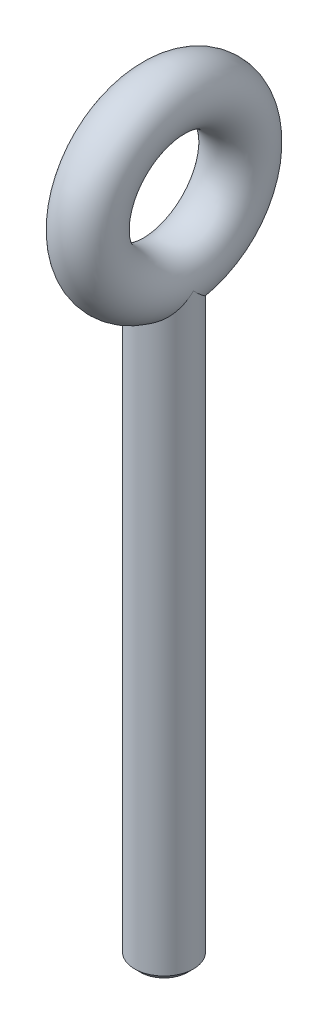
ISO-10303-21;
HEADER;
FILE_DESCRIPTION(('STEP AP214'),'2;1');
FILE_NAME('part.step','',(''),(''),'','','');
FILE_SCHEMA(('AUTOMOTIVE_DESIGN { 1 0 10303 214 1 1 1 1 }'));
ENDSEC;
DATA;
#1=APPLICATION_CONTEXT('core data for automotive mechanical design processes');
#2=APPLICATION_PROTOCOL_DEFINITION('international standard','automotive_design',2000,#1);
#3=PRODUCT_CONTEXT('',#1,'mechanical');
#4=PRODUCT('Part','Part','',(#3));
#5=PRODUCT_RELATED_PRODUCT_CATEGORY('part','',(#4));
#6=PRODUCT_DEFINITION_FORMATION('','',#4);
#7=PRODUCT_DEFINITION_CONTEXT('part definition',#1,'design');
#8=PRODUCT_DEFINITION('design','',#6,#7);
#9=PRODUCT_DEFINITION_SHAPE('','',#8);
#10=(LENGTH_UNIT() NAMED_UNIT(*) SI_UNIT(.MILLI.,.METRE.));
#11=(NAMED_UNIT(*) PLANE_ANGLE_UNIT() SI_UNIT($,.RADIAN.));
#12=(NAMED_UNIT(*) SI_UNIT($,.STERADIAN.) SOLID_ANGLE_UNIT());
#13=UNCERTAINTY_MEASURE_WITH_UNIT(LENGTH_MEASURE(1.E-05),#10,'distance_accuracy_value','');
#14=(GEOMETRIC_REPRESENTATION_CONTEXT(3) GLOBAL_UNCERTAINTY_ASSIGNED_CONTEXT((#13)) GLOBAL_UNIT_ASSIGNED_CONTEXT((#10,
#11,#12)) REPRESENTATION_CONTEXT('',''));
#15=CARTESIAN_POINT('',(0.,0.,0.));
#16=DIRECTION('',(0.,0.,1.));
#17=DIRECTION('',(1.,0.,0.));
#18=AXIS2_PLACEMENT_3D('',#15,#16,#17);
#19=CARTESIAN_POINT('',(0.,57.,0.));
#20=DIRECTION('',(1.,0.,0.));
#21=DIRECTION('',(0.,0.,-1.));
#22=AXIS2_PLACEMENT_3D('',#19,#20,#21);
#23=TOROIDAL_SURFACE('',#22,6.5,2.5);
#24=CARTESIAN_POINT('',(2.5,50.5,0.));
#25=CARTESIAN_POINT('',(2.4999998519753,50.4651649450499,-0.0348344505926963));
#26=CARTESIAN_POINT('',(2.49927189941043,50.4304676053622,-0.0698082826245151));
#27=CARTESIAN_POINT('',(2.49633216551129,50.3615765351389,-0.139792227453699));
#28=CARTESIAN_POINT('',(2.49412892246899,50.3273810572834,-0.174800980537361));
#29=CARTESIAN_POINT('',(2.48822941530882,50.2595312191127,-0.244796587317837));
#30=CARTESIAN_POINT('',(2.48454243864865,50.2258748225426,-0.279782245642682));
#31=CARTESIAN_POINT('',(2.47566870387325,50.1591399280342,-0.349669598496871));
#32=CARTESIAN_POINT('',(2.47049199876416,50.1260590825694,-0.384570324713654));
#33=CARTESIAN_POINT('',(2.45863483508742,50.0605110677205,-0.454223498115312));
#34=CARTESIAN_POINT('',(2.45196520328561,50.0280412191219,-0.488975262976044));
#35=CARTESIAN_POINT('',(2.43712097010707,49.9637498764985,-0.558263726688536));
#36=CARTESIAN_POINT('',(2.42895797074275,49.9319253523633,-0.59280009522945));
#37=CARTESIAN_POINT('',(2.41112871125689,49.8689584869557,-0.661589292403945));
#38=CARTESIAN_POINT('',(2.40147482070587,49.837812744329,-0.695842208097105));
#39=CARTESIAN_POINT('',(2.38066814398586,49.7762352340584,-0.763993019045368));
#40=CARTESIAN_POINT('',(2.3695284804141,49.7457996840722,-0.797891499132737));
#41=CARTESIAN_POINT('',(2.34503626255162,49.6838497018394,-0.867312180624518));
#42=CARTESIAN_POINT('',(2.33159898290379,49.6523610258926,-0.902827554412127));
#43=CARTESIAN_POINT('',(2.30302708267719,49.590198054588,-0.973385329518642));
#44=CARTESIAN_POINT('',(2.28790563583952,49.5595194797625,-1.00842928926444));
#45=CARTESIAN_POINT('',(2.25597165670608,49.4990190219382,-1.07795984691651));
#46=CARTESIAN_POINT('',(2.23917299705823,49.4691923704029,-1.11244865831707));
#47=CARTESIAN_POINT('',(2.20389555666032,49.4104387224069,-1.18078394377793));
#48=CARTESIAN_POINT('',(2.18543126933451,49.3815064425272,-1.21463334819587));
#49=CARTESIAN_POINT('',(2.14683788839919,49.3245835551725,-1.28160347350607));
#50=CARTESIAN_POINT('',(2.12672381551575,49.2965871411921,-1.31472790469029));
#51=CARTESIAN_POINT('',(2.08485076598944,49.2415774283213,-1.38016096068789));
#52=CARTESIAN_POINT('',(2.06310722314869,49.21455779598,-1.41247412647261));
#53=CARTESIAN_POINT('',(2.01799983536828,49.1615425293011,-1.47619745561843));
#54=CARTESIAN_POINT('',(1.99465170286396,49.1355400396073,-1.50761302420075));
#55=CARTESIAN_POINT('',(1.94636440869489,49.0845989296952,-1.56945289650164));
#56=CARTESIAN_POINT('',(1.92144108489697,49.059652952365,-1.5998834968128));
#57=CARTESIAN_POINT('',(1.86827481321106,49.0091920995661,-1.66172044012805));
#58=CARTESIAN_POINT('',(1.83992261267587,48.9837314862613,-1.69307733209746));
#59=CARTESIAN_POINT('',(1.78149743865257,48.9341316306051,-1.75444632253051));
#60=CARTESIAN_POINT('',(1.75144413676242,48.9099818533725,-1.78446861568752));
#61=CARTESIAN_POINT('',(1.68967262573154,48.8630476111479,-1.84306459913477));
#62=CARTESIAN_POINT('',(1.65797349366026,48.8402521351544,-1.87164955443035));
#63=CARTESIAN_POINT('',(1.59297332072478,48.7960704029711,-1.92727019017921));
#64=CARTESIAN_POINT('',(1.55969045668714,48.7746727732271,-1.95431805353104));
#65=CARTESIAN_POINT('',(1.49159173930169,48.7333293460177,-2.00676708176753));
#66=CARTESIAN_POINT('',(1.45679286813338,48.7133719724325,-2.03218113991));
#67=CARTESIAN_POINT('',(1.38573871319276,48.6749512938846,-2.08126845902745));
#68=CARTESIAN_POINT('',(1.34949891991776,48.6564763980875,-2.10495505796956));
#69=CARTESIAN_POINT('',(1.2756413013032,48.6210602148965,-2.15050004763789));
#70=CARTESIAN_POINT('',(1.23803725698496,48.6041075664873,-2.17237186936554));
#71=CARTESIAN_POINT('',(1.18056518589665,48.5798168441105,-2.20379997485232));
#72=CARTESIAN_POINT('',(1.16128646235409,48.5719304635984,-2.21401896202216));
#73=CARTESIAN_POINT('',(1.12242007277858,48.5565545799554,-2.23397052295273));
#74=CARTESIAN_POINT('',(1.10283375518018,48.5490637606325,-2.24370470278832));
#75=CARTESIAN_POINT('',(1.06225218019391,48.5340735063834,-2.26321219369763));
#76=CARTESIAN_POINT('',(1.04123722038652,48.5265946016373,-2.27296030480897));
#77=CARTESIAN_POINT('',(0.998921100046556,48.5121017732341,-2.29187752025771));
#78=CARTESIAN_POINT('',(0.977621761813773,48.505085818838,-2.30104914360219));
#79=CARTESIAN_POINT('',(0.934752733102131,48.4915218190078,-2.318803311869));
#80=CARTESIAN_POINT('',(0.913184671359649,48.4849718268857,-2.32738830085755));
#81=CARTESIAN_POINT('',(0.869794416154352,48.4723426722087,-2.34395998326549));
#82=CARTESIAN_POINT('',(0.847973657026655,48.4662616606127,-2.35194902176108));
#83=CARTESIAN_POINT('',(0.804094486610989,48.4545732562204,-2.36732011428389));
#84=CARTESIAN_POINT('',(0.782037317347516,48.4489641263156,-2.37470439165565));
#85=CARTESIAN_POINT('',(0.737702078084783,48.4382221809127,-2.38885790757353));
#86=CARTESIAN_POINT('',(0.715425062374308,48.4330877543173,-2.39562922467928));
#87=CARTESIAN_POINT('',(0.670667132288324,48.4232978117753,-2.40854939010881));
#88=CARTESIAN_POINT('',(0.648187091742627,48.4186408246102,-2.41470014967389));
#89=CARTESIAN_POINT('',(0.603040352050533,48.4098082632042,-2.42637241392847));
#90=CARTESIAN_POINT('',(0.58037435624373,48.4056313710396,-2.43189564077238));
#91=CARTESIAN_POINT('',(0.534873168729661,48.3977614099155,-2.4423067074885));
#92=CARTESIAN_POINT('',(0.512038522509422,48.3940671890994,-2.44719605982718));
#93=CARTESIAN_POINT('',(0.466217704527621,48.387164891372,-2.4563339106165));
#94=CARTESIAN_POINT('',(0.443231935613273,48.3839558405927,-2.46058369277737));
#95=CARTESIAN_POINT('',(0.397126734920186,48.3780261158144,-2.46843761078168));
#96=CARTESIAN_POINT('',(0.374007580983801,48.3753046568067,-2.47204278440667));
#97=CARTESIAN_POINT('',(0.327653649856744,48.3703522621338,-2.47860337611999));
#98=CARTESIAN_POINT('',(0.304419045346194,48.3681207399483,-2.48155957112253));
#99=CARTESIAN_POINT('',(0.257852414064226,48.3641502797345,-2.48681878545555));
#100=CARTESIAN_POINT('',(0.234520476588794,48.362410961886,-2.48912230843619));
#101=CARTESIAN_POINT('',(0.187777526619067,48.3594268872479,-2.49307345851043));
#102=CARTESIAN_POINT('',(0.164366543425,48.3581819639775,-2.49472130639426));
#103=CARTESIAN_POINT('',(0.117483978984563,48.3561885662396,-2.49735907293355));
#104=CARTESIAN_POINT('',(0.0940123916718671,48.3554401435709,-2.49834892294168));
#105=CARTESIAN_POINT('',(0.0470272147667755,48.3544415642529,-2.49966941804036));
#106=CARTESIAN_POINT('',(0.0235136092073164,48.3541916808299,-2.49999970165321));
#107=CARTESIAN_POINT('',(-0.0235098489591216,48.3541918533658,-2.50000029829916));
#108=CARTESIAN_POINT('',(-0.0470197015649339,48.3544418293819,-2.49967071686497));
#109=CARTESIAN_POINT('',(-0.0939978817998217,48.355440363875,-2.498351541181));
#110=CARTESIAN_POINT('',(-0.117466224780002,48.3561886596246,-2.49736229472374));
#111=CARTESIAN_POINT('',(-0.164342816361563,48.3581816385001,-2.49472572127369));
#112=CARTESIAN_POINT('',(-0.187751069802164,48.3594262803053,-2.49307844906138));
#113=CARTESIAN_POINT('',(-0.234489080176357,48.3624096616642,-2.48912840176424));
#114=CARTESIAN_POINT('',(-0.257818805967819,48.364148578154,-2.48682539194381));
#115=CARTESIAN_POINT('',(-0.30438153550278,48.3681181481963,-2.48156714905981));
#116=CARTESIAN_POINT('',(-0.327614447495364,48.3703491919895,-2.47861139839198));
#117=CARTESIAN_POINT('',(-0.373965514514914,48.3753005831084,-2.47205162673672));
#118=CARTESIAN_POINT('',(-0.397083493801106,48.378021527327,-2.46844681493521));
#119=CARTESIAN_POINT('',(-0.44318686304689,48.3839502169147,-2.46059354047541));
#120=CARTESIAN_POINT('',(-0.466171971510394,48.387158757606,-2.45634402625764));
#121=CARTESIAN_POINT('',(-0.511991981004876,48.3940600703444,-2.44720661953958));
#122=CARTESIAN_POINT('',(-0.534826474959499,48.3977538265028,-2.44231742973582));
#123=CARTESIAN_POINT('',(-0.580327862576109,48.4056229340486,-2.43190658511575));
#124=CARTESIAN_POINT('',(-0.602994205968755,48.4097994474552,-2.42638340448501));
#125=CARTESIAN_POINT('',(-0.648142135385989,48.4186313672582,-2.41471111902706));
#126=CARTESIAN_POINT('',(-0.670623012761787,48.4232881016506,-2.40856027899907));
#127=CARTESIAN_POINT('',(-0.715383098667736,48.4330776942269,-2.39563982885528));
#128=CARTESIAN_POINT('',(-0.737661427561521,48.4382120336024,-2.38886829480477));
#129=CARTESIAN_POINT('',(-0.78199976086257,48.4489539994488,-2.37471421218043));
#130=CARTESIAN_POINT('',(-0.804058704709965,48.4545632468841,-2.36732957275457));
#131=CARTESIAN_POINT('',(-0.847941874751855,48.4662521191848,-2.3519576134141));
#132=CARTESIAN_POINT('',(-0.869764852218532,48.4723334909104,-2.34396805829835));
#133=CARTESIAN_POINT('',(-0.91315997720279,48.4849636385772,-2.32739519709452));
#134=CARTESIAN_POINT('',(-0.934730683293582,48.4915142732006,-2.31880953457037));
#135=CARTESIAN_POINT('',(-0.97760540684382,48.5050798599203,-2.30105384856487));
#136=CARTESIAN_POINT('',(-0.998907788089813,48.5120967681861,-2.29188137008064));
#137=CARTESIAN_POINT('',(-1.04123039982532,48.5265918717462,-2.27296233681007));
#138=CARTESIAN_POINT('',(-1.06224880032186,48.5340721072722,-2.26321325293876));
#139=CARTESIAN_POINT('',(-1.10283063651336,48.5490627516582,-2.24370673878632));
#140=CARTESIAN_POINT('',(-1.12241389668528,48.5565525026638,-2.23397466543976));
#141=CARTESIAN_POINT('',(-1.16127465158385,48.5719262076319,-2.21402702230444));
#142=CARTESIAN_POINT('',(-1.18055078959684,48.5798114853018,-2.20380983605891));
#143=CARTESIAN_POINT('',(-1.23801646657055,48.6040991940398,-2.17238642620318));
#144=CARTESIAN_POINT('',(-1.27561675353426,48.6210497404045,-2.15051741715825));
#145=CARTESIAN_POINT('',(-1.34946871672308,48.6564620290735,-2.10497701667277));
#146=CARTESIAN_POINT('',(-1.38570653908293,48.6749351902378,-2.08129212092188));
#147=CARTESIAN_POINT('',(-1.45675847967638,48.713352988636,-2.03220714488696));
#148=CARTESIAN_POINT('',(-1.49155703135241,48.7333092726573,-2.00679365979478));
#149=CARTESIAN_POINT('',(-1.55965667131643,48.7746513632311,-1.9543446794173));
#150=CARTESIAN_POINT('',(-1.59294069881749,48.7960487997092,-1.92729623079977));
#151=CARTESIAN_POINT('',(-1.65794459036228,48.8402312557111,-1.87167334312368));
#152=CARTESIAN_POINT('',(-1.68964619754656,48.8630277007096,-1.84308666836018));
#153=CARTESIAN_POINT('',(-1.75142379461288,48.9099651406946,-1.78448608546118));
#154=CARTESIAN_POINT('',(-1.78148062610771,48.9341171956675,-1.7544608656762));
#155=CARTESIAN_POINT('',(-1.83991396829833,48.9837233833919,-1.69308523056452));
#156=CARTESIAN_POINT('',(-1.86827072799475,49.0091881009102,-1.66172458421884));
#157=CARTESIAN_POINT('',(-1.92118265464717,49.0594077859494,-1.60018464088414));
#158=CARTESIAN_POINT('',(-1.94586518240318,49.0840995408988,-1.5700630134793));
#159=CARTESIAN_POINT('',(-1.99370587453825,49.134515482856,-1.508852687176));
#160=CARTESIAN_POINT('',(-2.01684834105614,49.1602469555359,-1.47775772895608));
#161=CARTESIAN_POINT('',(-2.06157960335483,49.2127055959365,-1.41468528774917));
#162=CARTESIAN_POINT('',(-2.08315282307876,49.2394395639169,-1.38270242757145));
#163=CARTESIAN_POINT('',(-2.12472026884154,49.2938651477256,-1.31793730551177));
#164=CARTESIAN_POINT('',(-2.14469918709449,49.3215630558554,-1.28515051740045));
#165=CARTESIAN_POINT('',(-2.18305698753735,49.3778779885534,-1.21886088541298));
#166=CARTESIAN_POINT('',(-2.20142096081103,49.4065007931137,-1.18535433510808));
#167=CARTESIAN_POINT('',(-2.23653195861863,49.464626259027,-1.1177078395738));
#168=CARTESIAN_POINT('',(-2.25326458363585,49.4941341903603,-1.08356495769166));
#169=CARTESIAN_POINT('',(-2.28510005352919,49.553989956597,-1.01472760720719));
#170=CARTESIAN_POINT('',(-2.30018910006889,49.5843425611018,-0.980030912843599));
#171=CARTESIAN_POINT('',(-2.32872860119819,49.6458470996289,-0.910166378056862));
#172=CARTESIAN_POINT('',(-2.3421659324066,49.6770033185529,-0.874996955337754));
#173=CARTESIAN_POINT('',(-2.36739704115857,49.740073599545,-0.804266208957821));
#174=CARTESIAN_POINT('',(-2.37917842643102,49.7719914795457,-0.768703878388408));
#175=CARTESIAN_POINT('',(-2.40109675690884,49.8365439080831,-0.697263165686169));
#176=CARTESIAN_POINT('',(-2.41122208364755,49.8691818369717,-0.661384268853634));
#177=CARTESIAN_POINT('',(-2.42671287575774,49.924081329438,-0.60145043926721));
#178=CARTESIAN_POINT('',(-2.43254689270961,49.9462154107089,-0.577398062448684));
#179=CARTESIAN_POINT('',(-2.4483966192659,50.0107758881543,-0.507567291616696));
#180=CARTESIAN_POINT('',(-2.45742617316521,50.0534620727118,-0.46180030591283));
#181=CARTESIAN_POINT('',(-2.47097438861045,50.129040283076,-0.381516232845513));
#182=CARTESIAN_POINT('',(-2.476055959948,50.1617961258178,-0.346963485794435));
#183=CARTESIAN_POINT('',(-2.48477553267264,50.227911808147,-0.277727005510637));
#184=CARTESIAN_POINT('',(-2.48840182071097,50.2612743745628,-0.243044391747973));
#185=CARTESIAN_POINT('',(-2.49421014917064,50.3285699278914,-0.173612867562044));
#186=CARTESIAN_POINT('',(-2.4963812762741,50.3625053103682,-0.13886537392439));
#187=CARTESIAN_POINT('',(-2.49928115378433,50.4309128841184,-0.0693641937674266));
#188=CARTESIAN_POINT('',(-2.49999977848938,50.4653871668859,-0.0346121414047399));
#189=CARTESIAN_POINT('',(-2.5,50.5,0.));
#190=B_SPLINE_CURVE_WITH_KNOTS('',3,(#24,#25,#26,#27,#28,#29,#30,#31,#32,#33,#34,#35,#36,#37,
#38,#39,#40,#41,#42,#43,#44,#45,#46,#47,#48,#49,#50,#51,#52,#53,#54,#55,#56,#57,#58,#59,#60,#61,
#62,#63,#64,#65,#66,#67,#68,#69,#70,#71,#72,#73,#74,#75,#76,#77,#78,#79,#80,#81,#82,#83,#84,#85,
#86,#87,#88,#89,#90,#91,#92,#93,#94,#95,#96,#97,#98,#99,#100,#101,#102,#103,#104,#105,#106,#107,
#108,#109,#110,#111,#112,#113,#114,#115,#116,#117,#118,#119,#120,#121,#122,#123,#124,#125,#126,
#127,#128,#129,#130,#131,#132,#133,#134,#135,#136,#137,#138,#139,#140,#141,#142,#143,#144,#145,
#146,#147,#148,#149,#150,#151,#152,#153,#154,#155,#156,#157,#158,#159,#160,#161,#162,#163,#164,
#165,#166,#167,#168,#169,#170,#171,#172,#173,#174,#175,#176,#177,#178,#179,#180,#181,#182,#183,
#184,#185,#186,#187,#188,#189),.UNSPECIFIED.,.F.,.F.,(4,2,2,2,2,2,2,2,2,2,2,2,2,2,2,2,2,2,2,2,2,
2,2,2,2,2,2,2,2,2,2,2,2,2,2,2,2,2,2,2,2,2,2,2,2,2,2,2,2,2,2,2,2,2,2,2,2,2,2,2,2,2,2,2,2,2,2,2,2,
2,2,2,2,2,2,2,2,2,2,2,2,2,4),(0.,0.147787301501814,0.294726588086739,0.440760067079174,
0.585830305700144,0.729880742725054,0.872856225587214,1.01470357238207,1.15537215792656,
1.3033257833089,1.45019410716643,1.59593500061896,1.74051166154291,1.88389341085666,
2.02605649624265,2.16698489430558,2.3066711002866,2.45465678545828,2.60118668288796,
2.74628874180017,2.89000589403029,3.03239672270653,3.17353594102112,3.31351464224773,
3.38310943386258,3.45245580254462,3.5254726778498,3.59814442353009,3.67049216572014,
3.74253829101281,3.81430639515864,3.8858212232596,3.95710860151888,4.02819536072194,
4.09910925174348,4.16987885349768,4.24053347387193,4.31110304430404,4.3816180087755,
4.4521092080956,4.52260776043932,4.59314493917321,4.66367083774555,4.73415958260072,
4.80464246050673,4.87515060108785,4.94571485460174,5.0163656724425,5.08713299140352,
5.1580461226633,5.22913364636826,5.3004233125846,5.37194194927794,5.44371537785998,
5.51576833671827,5.5881244130221,5.66080598297853,5.73383416059895,5.80316906227239,
5.8727539045852,6.01271729526377,6.15384735301244,6.29623518657971,6.43995549477602,
6.58506681798071,6.73161201856887,6.8796189513476,7.01790604335712,7.15743626536252,
7.29820228884042,7.44018848529375,7.58337168493592,7.7277219474618,7.8732033346465,
8.01977467627573,8.16739032247831,8.31600087689727,8.41560441468302,8.60523005053823,
8.74885318750058,8.89361019373258,9.03944104090023,9.18628504730156),.UNSPECIFIED.);
#191=CARTESIAN_POINT('',(2.5,50.5,0.));
#192=VERTEX_POINT('',#191);
#193=CARTESIAN_POINT('',(-2.5,50.5,0.));
#194=VERTEX_POINT('',#193);
#195=EDGE_CURVE('E11',#192,#194,#190,.T.);
#196=ORIENTED_EDGE('',*,*,#195,.T.);
#197=CARTESIAN_POINT('',(-2.5,50.5,0.));
#198=CARTESIAN_POINT('',(-2.49999985197531,50.4651649450577,0.0348344505847936));
#199=CARTESIAN_POINT('',(-2.49927189941076,50.4304676053776,0.0698082826085049));
#200=CARTESIAN_POINT('',(-2.49633216551282,50.361576535167,0.139792227423359));
#201=CARTESIAN_POINT('',(-2.49412892247132,50.3273810573167,0.174800980500815));
#202=CARTESIAN_POINT('',(-2.488229415313,50.259531219154,0.244796587270977));
#203=CARTESIAN_POINT('',(-2.48454243865381,50.2258748225868,0.279782245591728));
#204=CARTESIAN_POINT('',(-2.47566870388035,50.1591399280818,0.349669598440049));
#205=CARTESIAN_POINT('',(-2.47049199877213,50.1260590826176,0.384570324655068));
#206=CARTESIAN_POINT('',(-2.45863483509688,50.0605110677677,0.454223498055717));
#207=CARTESIAN_POINT('',(-2.45196520329557,50.0280412191677,0.488975262917209));
#208=CARTESIAN_POINT('',(-2.43712097011748,49.9637498765395,0.558263726633952));
#209=CARTESIAN_POINT('',(-2.428957970753,49.931925352401,0.592800095178359));
#210=CARTESIAN_POINT('',(-2.41112871126601,49.8689584869849,0.661589292362658));
#211=CARTESIAN_POINT('',(-2.40147482071389,49.8378127443532,0.695842208062125));
#212=CARTESIAN_POINT('',(-2.38066814399067,49.776235234071,0.76399301902629));
#213=CARTESIAN_POINT('',(-2.36952848041669,49.7457996840785,0.797891499123242));
#214=CARTESIAN_POINT('',(-2.34503626255767,49.683849701855,0.867312180609664));
#215=CARTESIAN_POINT('',(-2.3315989829167,49.6523610259234,0.90282755438242));
#216=CARTESIAN_POINT('',(-2.30302708270334,49.5901980546436,0.973385329462724));
#217=CARTESIAN_POINT('',(-2.28790563587182,49.5595194798279,1.00842928919715));
#218=CARTESIAN_POINT('',(-2.25597165674961,49.4990190220182,1.07795984683063));
#219=CARTESIAN_POINT('',(-2.23917299710661,49.4691923704879,1.11244865822394));
#220=CARTESIAN_POINT('',(-2.20389555671664,49.4104387224973,1.18078394367469));
#221=CARTESIAN_POINT('',(-2.18543126939369,49.3815064426182,1.21463334808972));
#222=CARTESIAN_POINT('',(-2.1468378884617,49.3245835552607,1.28160347339875));
#223=CARTESIAN_POINT('',(-2.12672381557851,49.296587141277,1.31472790458465));
#224=CARTESIAN_POINT('',(-2.0848507660497,49.2415774283962,1.38016096059049));
#225=CARTESIAN_POINT('',(-2.06310722320596,49.2145577960483,1.41247412638171));
#226=CARTESIAN_POINT('',(-2.01799983541596,49.1615425293533,1.4761974555454));
#227=CARTESIAN_POINT('',(-1.99465170290478,49.1355400396501,1.50761302413901));
#228=CARTESIAN_POINT('',(-1.94636440871811,49.0845989297174,1.56945289646811));
#229=CARTESIAN_POINT('',(-1.9214410849092,49.0596529523761,1.59988349679608));
#230=CARTESIAN_POINT('',(-1.86827481323249,49.009192099587,1.66172044010576));
#231=CARTESIAN_POINT('',(-1.83992261271986,48.9837314863018,1.69307733205384));
#232=CARTESIAN_POINT('',(-1.78149743873745,48.9341316306764,1.75444632244989));
#233=CARTESIAN_POINT('',(-1.7514441368652,48.9099818534551,1.78446861559103));
#234=CARTESIAN_POINT('',(-1.6896726258651,48.8630476112463,1.84306459901314));
#235=CARTESIAN_POINT('',(-1.65797349380629,48.8402521352574,1.8716495542992));
#236=CARTESIAN_POINT('',(-1.59297332088957,48.7960704030774,1.92727019003559));
#237=CARTESIAN_POINT('',(-1.55969045685781,48.7746727733324,1.95431805338419));
#238=CARTESIAN_POINT('',(-1.49159173947708,48.7333293461161,2.00676708162086));
#239=CARTESIAN_POINT('',(-1.45679286830718,48.7133719725255,2.03218113976644));
#240=CARTESIAN_POINT('',(-1.38573871335548,48.6749512939632,2.08126845889666));
#241=CARTESIAN_POINT('',(-1.34949892007057,48.6564763981576,2.10495505784809));
#242=CARTESIAN_POINT('',(-1.2756413014276,48.6210602149475,2.15050004754158));
#243=CARTESIAN_POINT('',(-1.23803725709046,48.604107566528,2.17237186928469));
#244=CARTESIAN_POINT('',(-1.18056518597005,48.5798168441367,2.20379997479745));
#245=CARTESIAN_POINT('',(-1.16128646241449,48.5719304636192,2.21401896197722));
#246=CARTESIAN_POINT('',(-1.12242007281063,48.5565545799657,2.23397052292935));
#247=CARTESIAN_POINT('',(-1.10283375519683,48.5490637606377,2.24370470277652));
#248=CARTESIAN_POINT('',(-1.06225218020151,48.5340735063873,2.263212193698));
#249=CARTESIAN_POINT('',(-1.04123722040086,48.5265946016446,2.27296030481047));
#250=CARTESIAN_POINT('',(-0.998921100073561,48.5121017732473,2.29187752026118));
#251=CARTESIAN_POINT('',(-0.977621761846698,48.5050858188538,2.3010491436065));
#252=CARTESIAN_POINT('',(-0.934752733146146,48.4915218190279,2.31880331187502));
#253=CARTESIAN_POINT('',(-0.913184671408823,48.4849718269076,2.32738830086442));
#254=CARTESIAN_POINT('',(-0.869794416213021,48.4723426722336,2.34395998327401));
#255=CARTESIAN_POINT('',(-0.847973657089649,48.4662616606389,2.35194902177036));
#256=CARTESIAN_POINT('',(-0.804094486681783,48.4545732562484,2.36732011429465));
#257=CARTESIAN_POINT('',(-0.782037317421773,48.4489641263442,2.3747043916671));
#258=CARTESIAN_POINT('',(-0.737702078165079,48.4382221809421,2.38885790758627));
#259=CARTESIAN_POINT('',(-0.71542506245717,48.4330877543468,2.3956292246926));
#260=CARTESIAN_POINT('',(-0.6706671323754,48.4232978118046,2.40854939012321));
#261=CARTESIAN_POINT('',(-0.648187091831342,48.4186408246392,2.41470014968875));
#262=CARTESIAN_POINT('',(-0.603040352141583,48.4098082632321,2.42637241394412));
#263=CARTESIAN_POINT('',(-0.580374356335468,48.4056313710668,2.43189564078834));
#264=CARTESIAN_POINT('',(-0.534873168821808,48.3977614099411,2.44230670750495));
#265=CARTESIAN_POINT('',(-0.512038522601284,48.3940671891241,2.44719605984377));
#266=CARTESIAN_POINT('',(-0.466217704617933,48.3871648913946,2.45633391063322));
#267=CARTESIAN_POINT('',(-0.443231935702312,48.3839558406142,2.46058369279405));
#268=CARTESIAN_POINT('',(-0.397126735005684,48.3780261158333,2.46843761079809));
#269=CARTESIAN_POINT('',(-0.374007581067025,48.3753046568244,2.47204278442283));
#270=CARTESIAN_POINT('',(-0.327653649934419,48.3703522621489,2.47860337613542));
#271=CARTESIAN_POINT('',(-0.304419045420587,48.3681207399621,2.48155957113747));
#272=CARTESIAN_POINT('',(-0.257852414131051,48.3641502797456,2.48681878546927));
#273=CARTESIAN_POINT('',(-0.234520476651329,48.3624109618959,2.48912230844916));
#274=CARTESIAN_POINT('',(-0.187777526672015,48.3594268872553,2.49307345852163));
#275=CARTESIAN_POINT('',(-0.16436654347265,48.3581819639837,2.49472130640441));
#276=CARTESIAN_POINT('',(-0.117483979020617,48.3561885662436,2.49735907294137));
#277=CARTESIAN_POINT('',(-0.0940123917016217,48.3554401435739,2.49834892294817));
#278=CARTESIAN_POINT('',(-0.0470272147829426,48.3544415642541,2.49966941804383));
#279=CARTESIAN_POINT('',(-0.0235136092161942,48.3541916808304,2.49999970165495));
#280=CARTESIAN_POINT('',(0.0235098489627446,48.3541918533652,2.50000029829734));
#281=CARTESIAN_POINT('',(0.0470197015737684,48.3544418293809,2.49967071686136));
#282=CARTESIAN_POINT('',(0.0939978818183719,48.3554403638736,2.498351541174));
#283=CARTESIAN_POINT('',(0.117466224803057,48.3561886596232,2.49736229471516));
#284=CARTESIAN_POINT('',(0.16434281639291,48.3581816384989,2.49472572126209));
#285=CARTESIAN_POINT('',(0.187751069837301,48.3594262803042,2.49307844904837));
#286=CARTESIAN_POINT('',(0.23448908021835,48.3624096616638,2.48912840174858));
#287=CARTESIAN_POINT('',(0.257818806012882,48.364148578154,2.48682539192694));
#288=CARTESIAN_POINT('',(0.304381535553256,48.3681181481972,2.4815671490407));
#289=CARTESIAN_POINT('',(0.327614447548187,48.370349191991,2.47861139837185));
#290=CARTESIAN_POINT('',(0.373965514571708,48.375300583111,2.47205162671481));
#291=CARTESIAN_POINT('',(0.397083493859528,48.3780215273303,2.46844681491253));
#292=CARTESIAN_POINT('',(0.443186863107847,48.3839502169193,2.46059354045142));
#293=CARTESIAN_POINT('',(0.466171971572264,48.3871587576112,2.45634402623313));
#294=CARTESIAN_POINT('',(0.511991981067859,48.3940600703509,2.44720661951427));
#295=CARTESIAN_POINT('',(0.534826475022689,48.39775382651,2.44231742971026));
#296=CARTESIAN_POINT('',(0.58032786263901,48.4056229340569,2.43190658508992));
#297=CARTESIAN_POINT('',(0.602994206031168,48.409799447464,2.42638340445919));
#298=CARTESIAN_POINT('',(0.648142135446737,48.4186313672679,2.41471111900155));
#299=CARTESIAN_POINT('',(0.670623012821367,48.4232881016608,2.40856027897387));
#300=CARTESIAN_POINT('',(0.715383098724309,48.4330776942376,2.39563982883098));
#301=CARTESIAN_POINT('',(0.737661427616264,48.4382120336134,2.38886829478108));
#302=CARTESIAN_POINT('',(0.781999760913002,48.4489539994599,2.37471421215826));
#303=CARTESIAN_POINT('',(0.804058704757926,48.4545632468952,2.36732957273333));
#304=CARTESIAN_POINT('',(0.847941874794247,48.4662521191955,2.35195761339503));
#305=CARTESIAN_POINT('',(0.869764852257836,48.4723334909207,2.34396805828054));
#306=CARTESIAN_POINT('',(0.913159977235316,48.4849636385863,2.32739519707953));
#307=CARTESIAN_POINT('',(0.934730683322429,48.491514273209,2.31880953455697));
#308=CARTESIAN_POINT('',(0.977605406864738,48.5050798599269,2.30105384855498));
#309=CARTESIAN_POINT('',(0.998907788106492,48.5120967681915,2.29188137007269));
#310=CARTESIAN_POINT('',(1.04123039983298,48.5265918717489,2.27296233680632));
#311=CARTESIAN_POINT('',(1.06224880032476,48.5340721072733,2.26321325293729));
#312=CARTESIAN_POINT('',(1.10283063650493,48.5490627516551,2.24370673879034));
#313=CARTESIAN_POINT('',(1.12241389667032,48.5565525026581,2.23397466544704));
#314=CARTESIAN_POINT('',(1.16127465155689,48.5719262076209,2.21402702231786));
#315=CARTESIAN_POINT('',(1.18055078956438,48.5798114852881,2.20380983607518));
#316=CARTESIAN_POINT('',(1.23801646652444,48.604099194019,2.17238642622676));
#317=CARTESIAN_POINT('',(1.27561675348016,48.6210497403788,2.15051741718631));
#318=CARTESIAN_POINT('',(1.34946871665694,48.6564620290389,2.10497701670823));
#319=CARTESIAN_POINT('',(1.38570653901262,48.6749351901992,2.08129212096011));
#320=CARTESIAN_POINT('',(1.45675847960137,48.713352988591,2.03220714492911));
#321=CARTESIAN_POINT('',(1.49155703127673,48.73330927261,2.00679365983792));
#322=CARTESIAN_POINT('',(1.55965667124274,48.7746513631809,1.9543446794607));
#323=CARTESIAN_POINT('',(1.59294069874629,48.7960487996587,1.92729623084232));
#324=CARTESIAN_POINT('',(1.65794459029902,48.8402312556625,1.87167334316281));
#325=CARTESIAN_POINT('',(1.68964619748857,48.8630277006632,1.84308666839663));
#326=CARTESIAN_POINT('',(1.7514237945679,48.9099651406556,1.78448608549044));
#327=CARTESIAN_POINT('',(1.78148062607031,48.9341171956337,1.75446086570088));
#328=CARTESIAN_POINT('',(1.83991396827824,48.9837233833722,1.6930852305786));
#329=CARTESIAN_POINT('',(1.86827072798423,49.0091881008995,1.66172458422685));
#330=CARTESIAN_POINT('',(1.92118265464477,49.0594077859479,1.60018464089095));
#331=CARTESIAN_POINT('',(1.94586518240004,49.0840995408973,1.5700630134913));
#332=CARTESIAN_POINT('',(1.9937058745338,49.1345154828541,1.50885268719702));
#333=CARTESIAN_POINT('',(2.01684834105108,49.1602469555337,1.47775772898092));
#334=CARTESIAN_POINT('',(2.06157960334888,49.2127055959334,1.41468528778063));
#335=CARTESIAN_POINT('',(2.08315282307247,49.2394395639135,1.38270242760571));
#336=CARTESIAN_POINT('',(2.12472026883483,49.2938651477213,1.31793730555056));
#337=CARTESIAN_POINT('',(2.14469918708765,49.3215630558506,1.28515051744095));
#338=CARTESIAN_POINT('',(2.18305698753046,49.3778779885477,1.21886088545592));
#339=CARTESIAN_POINT('',(2.2014209608042,49.4065007931077,1.18535433515172));
#340=CARTESIAN_POINT('',(2.23653195861206,49.4646262590202,1.11770783961786));
#341=CARTESIAN_POINT('',(2.25326458362948,49.4941341903533,1.08356495773542));
#342=CARTESIAN_POINT('',(2.28510005352335,49.5539899565895,1.0147276072494));
#343=CARTESIAN_POINT('',(2.30018910006335,49.5843425610941,0.980030912884566));
#344=CARTESIAN_POINT('',(2.32872860119336,49.6458470996211,0.910166378094429));
#345=CARTESIAN_POINT('',(2.34216593240215,49.6770033185451,0.874996955373164));
#346=CARTESIAN_POINT('',(2.36739704115493,49.7400735995375,0.804266208988047));
#347=CARTESIAN_POINT('',(2.37917842642779,49.7719914795385,0.768703878415604));
#348=CARTESIAN_POINT('',(2.40109675690646,49.8365439080768,0.697263165706545));
#349=CARTESIAN_POINT('',(2.4112220836456,49.869181836966,0.661384268870219));
#350=CARTESIAN_POINT('',(2.42671287575641,49.9240813294333,0.601450439276822));
#351=CARTESIAN_POINT('',(2.43254689270852,49.9462154107048,0.577398062455227));
#352=CARTESIAN_POINT('',(2.44839661926895,50.0107758881661,0.507567291599835));
#353=CARTESIAN_POINT('',(2.45742617317129,50.0534620727399,0.461800305876152));
#354=CARTESIAN_POINT('',(2.47097438861887,50.1290402831267,0.381516232783863));
#355=CARTESIAN_POINT('',(2.47605595995647,50.1617961258743,0.34696348572723));
#356=CARTESIAN_POINT('',(2.48477553267989,50.2279118082091,0.277727005439554));
#357=CARTESIAN_POINT('',(2.48840182071724,50.2612743746246,0.243044391678543));
#358=CARTESIAN_POINT('',(2.49421014917445,50.3285699279462,0.173612867502631));
#359=CARTESIAN_POINT('',(2.49638127627672,50.3625053104162,0.138865373873304));
#360=CARTESIAN_POINT('',(2.49928115378491,50.430912884146,0.069364193739089));
#361=CARTESIAN_POINT('',(2.49999977848939,50.4653871668999,0.0346121413907773));
#362=CARTESIAN_POINT('',(2.5,50.5,0.));
#363=B_SPLINE_CURVE_WITH_KNOTS('',3,(#197,#198,#199,#200,#201,#202,#203,#204,#205,#206,#207,
#208,#209,#210,#211,#212,#213,#214,#215,#216,#217,#218,#219,#220,#221,#222,#223,#224,#225,#226,
#227,#228,#229,#230,#231,#232,#233,#234,#235,#236,#237,#238,#239,#240,#241,#242,#243,#244,#245,
#246,#247,#248,#249,#250,#251,#252,#253,#254,#255,#256,#257,#258,#259,#260,#261,#262,#263,#264,
#265,#266,#267,#268,#269,#270,#271,#272,#273,#274,#275,#276,#277,#278,#279,#280,#281,#282,#283,
#284,#285,#286,#287,#288,#289,#290,#291,#292,#293,#294,#295,#296,#297,#298,#299,#300,#301,#302,
#303,#304,#305,#306,#307,#308,#309,#310,#311,#312,#313,#314,#315,#316,#317,#318,#319,#320,#321,
#322,#323,#324,#325,#326,#327,#328,#329,#330,#331,#332,#333,#334,#335,#336,#337,#338,#339,#340,
#341,#342,#343,#344,#345,#346,#347,#348,#349,#350,#351,#352,#353,#354,#355,#356,#357,#358,#359,
#360,#361,#362),.UNSPECIFIED.,.F.,.F.,(4,2,2,2,2,2,2,2,2,2,2,2,2,2,2,2,2,2,2,2,2,2,2,2,2,2,2,2,
2,2,2,2,2,2,2,2,2,2,2,2,2,2,2,2,2,2,2,2,2,2,2,2,2,2,2,2,2,2,2,2,2,2,2,2,2,2,2,2,2,2,2,2,2,2,2,2,
2,2,2,2,2,2,4),(0.,0.147787301468488,0.294726588029192,0.440760067006726,0.585830305622341,
0.729880742651655,0.87285622552815,1.01470357234745,1.15537215792661,1.30332578324219,
1.45019410705133,1.59593500047427,1.74051166138777,1.88389341071051,2.02605649612514,
2.16698489423653,2.30667110028589,2.45465678534772,2.60118668269835,2.74628874156272,
2.89000589377654,3.03239672246813,3.17353594082973,3.31351464213486,3.38310943380069,
3.45245580254145,3.52547267782739,3.59814442349081,3.67049216566644,3.74253829094716,
3.81430639508361,3.88582122317779,3.95710860143296,4.02819536063461,4.0991092516575,
4.16987885341586,4.24053347379712,4.31110304423913,4.38161800872343,4.45210920805931,
4.52260776042182,4.59314493917751,4.66367083776555,4.7341595826344,4.80464246055208,
4.87515060114277,4.94571485466416,5.01636567251028,5.08713299147452,5.15804612273534,
5.22913364643918,5.30042331265221,5.37194194934002,5.44371537791433,5.51576833676267,
5.58812441305434,5.66080598299641,5.73383416060026,5.80316906225044,5.87275390454312,
6.0127172951908,6.15384735292103,6.29623518648224,6.43995549468477,6.58506681790777,
6.73161201852613,6.8796189513467,7.01790604334483,7.15743626534106,7.2982022888121,
7.44018848526091,7.58337168490093,7.72772194742708,7.87320333461442,8.01977467624869,
8.16739032245868,8.3160008768874,8.41560441468094,8.6052300506133,8.74885318759966,
8.89361019382724,9.03944104096266,9.18628504730462),.UNSPECIFIED.);
#364=EDGE_CURVE('E31',#194,#192,#363,.T.);
#365=ORIENTED_EDGE('',*,*,#364,.T.);
#366=EDGE_LOOP('',(#196,#365));
#367=FACE_BOUND('',#366,.T.);
#368=ADVANCED_FACE('F19',(#367),#23,.T.);
#369=CARTESIAN_POINT('',(0.,0.,0.));
#370=DIRECTION('',(0.,-1.,0.));
#371=DIRECTION('',(-1.,0.,0.));
#372=AXIS2_PLACEMENT_3D('',#369,#370,#371);
#373=PLANE('',#372);
#374=CARTESIAN_POINT('',(0.,0.,0.));
#375=DIRECTION('',(0.,-1.,0.));
#376=DIRECTION('',(1.,0.,0.));
#377=AXIS2_PLACEMENT_3D('',#374,#375,#376);
#378=CIRCLE('',#377,2.);
#379=CARTESIAN_POINT('',(2.,0.,0.));
#380=VERTEX_POINT('',#379);
#381=EDGE_CURVE('E44',#380,#380,#378,.T.);
#382=ORIENTED_EDGE('',*,*,#381,.T.);
#383=EDGE_LOOP('',(#382));
#384=FACE_BOUND('',#383,.T.);
#385=ADVANCED_FACE('F21',(#384),#373,.T.);
#386=CARTESIAN_POINT('',(0.,25.25,0.));
#387=DIRECTION('',(0.,-1.,0.));
#388=DIRECTION('',(1.,0.,0.));
#389=AXIS2_PLACEMENT_3D('',#386,#387,#388);
#390=CYLINDRICAL_SURFACE('',#389,2.5);
#391=ORIENTED_EDGE('',*,*,#364,.F.);
#392=ORIENTED_EDGE('',*,*,#195,.F.);
#393=EDGE_LOOP('',(#391,#392));
#394=FACE_BOUND('',#393,.T.);
#395=CARTESIAN_POINT('',(0.,0.5,0.));
#396=DIRECTION('',(0.,1.,0.));
#397=DIRECTION('',(1.,0.,0.));
#398=AXIS2_PLACEMENT_3D('',#395,#396,#397);
#399=CIRCLE('',#398,2.5);
#400=CARTESIAN_POINT('',(2.5,0.5,0.));
#401=VERTEX_POINT('',#400);
#402=EDGE_CURVE('E48',#401,#401,#399,.T.);
#403=ORIENTED_EDGE('',*,*,#402,.T.);
#404=EDGE_LOOP('',(#403));
#405=FACE_BOUND('',#404,.T.);
#406=ADVANCED_FACE('F49',(#394,#405),#390,.T.);
#407=CARTESIAN_POINT('',(0.,0.25,0.));
#408=DIRECTION('',(0.,1.,0.));
#409=DIRECTION('',(1.,0.,0.));
#410=AXIS2_PLACEMENT_3D('',#407,#408,#409);
#411=CONICAL_SURFACE('',#410,2.25,0.785398163397448);
#412=ORIENTED_EDGE('',*,*,#381,.F.);
#413=EDGE_LOOP('',(#412));
#414=FACE_BOUND('',#413,.T.);
#415=ORIENTED_EDGE('',*,*,#402,.F.);
#416=EDGE_LOOP('',(#415));
#417=FACE_BOUND('',#416,.T.);
#418=ADVANCED_FACE('F67',(#414,#417),#411,.T.);
#419=CLOSED_SHELL('',(#368,#385,#406,#418));
#420=MANIFOLD_SOLID_BREP('B1',#419);
#421=ADVANCED_BREP_SHAPE_REPRESENTATION('',(#18,#420),#14);
#422=SHAPE_DEFINITION_REPRESENTATION(#9,#421);
ENDSEC;
END-ISO-10303-21;
